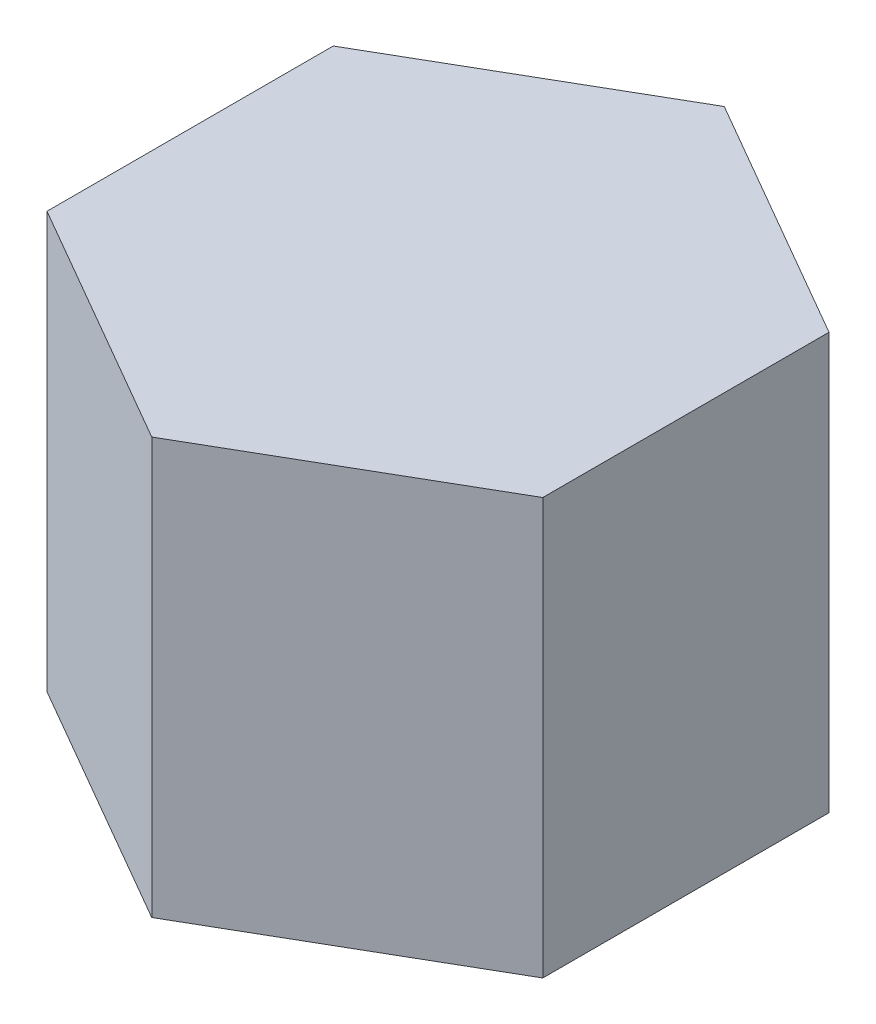
ISO-10303-21;
HEADER;
FILE_DESCRIPTION(('STEP AP214'),'2;1');
FILE_NAME('part.step','',(''),(''),'','','');
FILE_SCHEMA(('AUTOMOTIVE_DESIGN { 1 0 10303 214 1 1 1 1 }'));
ENDSEC;
DATA;
#1=APPLICATION_CONTEXT('core data for automotive mechanical design processes');
#2=APPLICATION_PROTOCOL_DEFINITION('international standard','automotive_design',2000,#1);
#3=PRODUCT_CONTEXT('',#1,'mechanical');
#4=PRODUCT('Part','Part','',(#3));
#5=PRODUCT_RELATED_PRODUCT_CATEGORY('part','',(#4));
#6=PRODUCT_DEFINITION_FORMATION('','',#4);
#7=PRODUCT_DEFINITION_CONTEXT('part definition',#1,'design');
#8=PRODUCT_DEFINITION('design','',#6,#7);
#9=PRODUCT_DEFINITION_SHAPE('','',#8);
#10=(LENGTH_UNIT() NAMED_UNIT(*) SI_UNIT(.MILLI.,.METRE.));
#11=(NAMED_UNIT(*) PLANE_ANGLE_UNIT() SI_UNIT($,.RADIAN.));
#12=(NAMED_UNIT(*) SI_UNIT($,.STERADIAN.) SOLID_ANGLE_UNIT());
#13=UNCERTAINTY_MEASURE_WITH_UNIT(LENGTH_MEASURE(1.E-05),#10,'distance_accuracy_value','');
#14=(GEOMETRIC_REPRESENTATION_CONTEXT(3) GLOBAL_UNCERTAINTY_ASSIGNED_CONTEXT((#13)) GLOBAL_UNIT_ASSIGNED_CONTEXT((#10,
#11,#12)) REPRESENTATION_CONTEXT('',''));
#15=CARTESIAN_POINT('',(0.,0.,0.));
#16=DIRECTION('',(0.,0.,1.));
#17=DIRECTION('',(1.,0.,0.));
#18=AXIS2_PLACEMENT_3D('',#15,#16,#17);
#19=CARTESIAN_POINT('',(208.839551417382,-147.556598747966,289.083895009141));
#20=DIRECTION('',(-0.499999999999978,0.,-0.866025403784452));
#21=DIRECTION('',(-0.866025403784452,0.,0.499999999999978));
#22=AXIS2_PLACEMENT_3D('',#19,#20,#21);
#23=PLANE('',#22);
#24=CARTESIAN_POINT('',(209.142660308706,-147.047793579175,288.908895009141));
#25=DIRECTION('',(-0.866025403784452,0.,0.499999999999978));
#26=VECTOR('',#25,1.);
#27=LINE('',#24,#26);
#28=CARTESIAN_POINT('',(209.142660308706,-147.047793579175,288.908895009141));
#29=VERTEX_POINT('',#28);
#30=CARTESIAN_POINT('',(208.839551417382,-147.047793579175,289.083895009141));
#31=VERTEX_POINT('',#30);
#32=EDGE_CURVE('E170',#29,#31,#27,.T.);
#33=ORIENTED_EDGE('',*,*,#32,.T.);
#34=CARTESIAN_POINT('',(208.839551417382,-147.556598747966,289.083895009141));
#35=DIRECTION('',(0.,1.,0.));
#36=VECTOR('',#35,1.);
#37=LINE('',#34,#36);
#38=CARTESIAN_POINT('',(208.839551417382,-147.556598747966,289.083895009141));
#39=VERTEX_POINT('',#38);
#40=EDGE_CURVE('E35',#39,#31,#37,.T.);
#41=ORIENTED_EDGE('',*,*,#40,.F.);
#42=CARTESIAN_POINT('',(209.142660308706,-147.556598747966,288.908895009141));
#43=DIRECTION('',(-0.866025403784452,0.,0.499999999999978));
#44=VECTOR('',#43,1.);
#45=LINE('',#42,#44);
#46=CARTESIAN_POINT('',(209.142660308706,-147.556598747966,288.908895009141));
#47=VERTEX_POINT('',#46);
#48=EDGE_CURVE('E159',#47,#39,#45,.T.);
#49=ORIENTED_EDGE('',*,*,#48,.F.);
#50=CARTESIAN_POINT('',(209.142660308706,-147.556598747966,288.908895009141));
#51=DIRECTION('',(0.,1.,0.));
#52=VECTOR('',#51,1.);
#53=LINE('',#50,#52);
#54=EDGE_CURVE('E10',#47,#29,#53,.T.);
#55=ORIENTED_EDGE('',*,*,#54,.T.);
#56=EDGE_LOOP('',(#33,#41,#49,#55));
#57=FACE_BOUND('',#56,.T.);
#58=ADVANCED_FACE('F16',(#57),#23,.F.);
#59=CARTESIAN_POINT('',(209.142660308706,-147.556598747966,291.594471220494));
#60=DIRECTION('',(-1.,0.,0.));
#61=DIRECTION('',(0.,-1.,0.));
#62=AXIS2_PLACEMENT_3D('',#59,#60,#61);
#63=PLANE('',#62);
#64=CARTESIAN_POINT('',(209.142660308706,-147.047793579175,288.558895009141));
#65=DIRECTION('',(0.,0.,1.));
#66=VECTOR('',#65,1.);
#67=LINE('',#64,#66);
#68=CARTESIAN_POINT('',(209.142660308706,-147.047793579175,288.558895009141));
#69=VERTEX_POINT('',#68);
#70=EDGE_CURVE('E167',#69,#29,#67,.T.);
#71=ORIENTED_EDGE('',*,*,#70,.T.);
#72=ORIENTED_EDGE('',*,*,#54,.F.);
#73=CARTESIAN_POINT('',(209.142660308706,-147.556598747966,288.558895009141));
#74=DIRECTION('',(0.,0.,1.));
#75=VECTOR('',#74,1.);
#76=LINE('',#73,#75);
#77=CARTESIAN_POINT('',(209.142660308706,-147.556598747966,288.558895009141));
#78=VERTEX_POINT('',#77);
#79=EDGE_CURVE('E156',#78,#47,#76,.T.);
#80=ORIENTED_EDGE('',*,*,#79,.F.);
#81=CARTESIAN_POINT('',(209.142660308706,-147.556598747966,288.558895009141));
#82=DIRECTION('',(0.,1.,0.));
#83=VECTOR('',#82,1.);
#84=LINE('',#81,#83);
#85=EDGE_CURVE('E27',#78,#69,#84,.T.);
#86=ORIENTED_EDGE('',*,*,#85,.T.);
#87=EDGE_LOOP('',(#71,#72,#80,#86));
#88=FACE_BOUND('',#87,.T.);
#89=ADVANCED_FACE('F189',(#88),#63,.F.);
#90=CARTESIAN_POINT('',(209.142660308706,-147.556598747966,288.558895009141));
#91=DIRECTION('',(-0.499999999999943,0.,0.866025403784471));
#92=DIRECTION('',(0.866025403784471,0.,0.499999999999943));
#93=AXIS2_PLACEMENT_3D('',#90,#91,#92);
#94=PLANE('',#93);
#95=CARTESIAN_POINT('',(208.839551417382,-147.047793579175,288.383895009141));
#96=DIRECTION('',(0.866025403784471,0.,0.499999999999943));
#97=VECTOR('',#96,1.);
#98=LINE('',#95,#97);
#99=CARTESIAN_POINT('',(208.839551417382,-147.047793579175,288.383895009141));
#100=VERTEX_POINT('',#99);
#101=EDGE_CURVE('E163',#100,#69,#98,.T.);
#102=ORIENTED_EDGE('',*,*,#101,.T.);
#103=ORIENTED_EDGE('',*,*,#85,.F.);
#104=CARTESIAN_POINT('',(208.839551417382,-147.556598747966,288.383895009141));
#105=DIRECTION('',(0.866025403784471,0.,0.499999999999943));
#106=VECTOR('',#105,1.);
#107=LINE('',#104,#106);
#108=CARTESIAN_POINT('',(208.839551417382,-147.556598747966,288.383895009141));
#109=VERTEX_POINT('',#108);
#110=EDGE_CURVE('E106',#109,#78,#107,.T.);
#111=ORIENTED_EDGE('',*,*,#110,.F.);
#112=CARTESIAN_POINT('',(208.839551417382,-147.556598747966,288.383895009141));
#113=DIRECTION('',(0.,1.,0.));
#114=VECTOR('',#113,1.);
#115=LINE('',#112,#114);
#116=EDGE_CURVE('E94',#109,#100,#115,.T.);
#117=ORIENTED_EDGE('',*,*,#116,.T.);
#118=EDGE_LOOP('',(#102,#103,#111,#117));
#119=FACE_BOUND('',#118,.T.);
#120=ADVANCED_FACE('F198',(#119),#94,.F.);
#121=CARTESIAN_POINT('',(208.839551417382,-147.556598747966,288.383895009141));
#122=DIRECTION('',(0.499999999999978,0.,0.866025403784452));
#123=DIRECTION('',(0.866025403784452,0.,-0.499999999999978));
#124=AXIS2_PLACEMENT_3D('',#121,#122,#123);
#125=PLANE('',#124);
#126=CARTESIAN_POINT('',(208.536442526057,-147.047793579175,288.558895009141));
#127=DIRECTION('',(0.866025403784452,0.,-0.499999999999978));
#128=VECTOR('',#127,1.);
#129=LINE('',#126,#128);
#130=CARTESIAN_POINT('',(208.536442526057,-147.047793579175,288.558895009141));
#131=VERTEX_POINT('',#130);
#132=EDGE_CURVE('E162',#131,#100,#129,.T.);
#133=ORIENTED_EDGE('',*,*,#132,.T.);
#134=ORIENTED_EDGE('',*,*,#116,.F.);
#135=CARTESIAN_POINT('',(208.536442526057,-147.556598747966,288.558895009141));
#136=DIRECTION('',(0.866025403784452,0.,-0.499999999999978));
#137=VECTOR('',#136,1.);
#138=LINE('',#135,#137);
#139=CARTESIAN_POINT('',(208.536442526057,-147.556598747966,288.558895009141));
#140=VERTEX_POINT('',#139);
#141=EDGE_CURVE('E98',#140,#109,#138,.T.);
#142=ORIENTED_EDGE('',*,*,#141,.F.);
#143=CARTESIAN_POINT('',(208.536442526057,-147.556598747966,288.558895009141));
#144=DIRECTION('',(0.,1.,0.));
#145=VECTOR('',#144,1.);
#146=LINE('',#143,#145);
#147=EDGE_CURVE('E79',#140,#131,#146,.T.);
#148=ORIENTED_EDGE('',*,*,#147,.T.);
#149=EDGE_LOOP('',(#133,#134,#142,#148));
#150=FACE_BOUND('',#149,.T.);
#151=ADVANCED_FACE('F100',(#150),#125,.F.);
#152=CARTESIAN_POINT('',(208.536442526057,-147.556598747966,291.594471220494));
#153=DIRECTION('',(1.,0.,0.));
#154=DIRECTION('',(0.,1.,0.));
#155=AXIS2_PLACEMENT_3D('',#152,#153,#154);
#156=PLANE('',#155);
#157=CARTESIAN_POINT('',(208.536442526057,-147.047793579175,288.908895009141));
#158=DIRECTION('',(0.,0.,-1.));
#159=VECTOR('',#158,1.);
#160=LINE('',#157,#159);
#161=CARTESIAN_POINT('',(208.536442526057,-147.047793579175,288.908895009141));
#162=VERTEX_POINT('',#161);
#163=EDGE_CURVE('E88',#162,#131,#160,.T.);
#164=ORIENTED_EDGE('',*,*,#163,.T.);
#165=ORIENTED_EDGE('',*,*,#147,.F.);
#166=CARTESIAN_POINT('',(208.536442526057,-147.556598747966,288.908895009141));
#167=DIRECTION('',(0.,0.,-1.));
#168=VECTOR('',#167,1.);
#169=LINE('',#166,#168);
#170=CARTESIAN_POINT('',(208.536442526057,-147.556598747966,288.908895009141));
#171=VERTEX_POINT('',#170);
#172=EDGE_CURVE('E84',#171,#140,#169,.T.);
#173=ORIENTED_EDGE('',*,*,#172,.F.);
#174=CARTESIAN_POINT('',(208.536442526057,-147.556598747966,288.908895009141));
#175=DIRECTION('',(0.,1.,0.));
#176=VECTOR('',#175,1.);
#177=LINE('',#174,#176);
#178=EDGE_CURVE('E58',#171,#162,#177,.T.);
#179=ORIENTED_EDGE('',*,*,#178,.T.);
#180=EDGE_LOOP('',(#164,#165,#173,#179));
#181=FACE_BOUND('',#180,.T.);
#182=ADVANCED_FACE('F82',(#181),#156,.F.);
#183=CARTESIAN_POINT('',(208.536442526057,-147.556598747966,288.908895009141));
#184=DIRECTION('',(0.499999999999943,0.,-0.866025403784471));
#185=DIRECTION('',(-0.866025403784471,0.,-0.499999999999943));
#186=AXIS2_PLACEMENT_3D('',#183,#184,#185);
#187=PLANE('',#186);
#188=CARTESIAN_POINT('',(208.839551417382,-147.047793579175,289.083895009141));
#189=DIRECTION('',(-0.866025403784471,0.,-0.499999999999943));
#190=VECTOR('',#189,1.);
#191=LINE('',#188,#190);
#192=EDGE_CURVE('E160',#31,#162,#191,.T.);
#193=ORIENTED_EDGE('',*,*,#192,.T.);
#194=ORIENTED_EDGE('',*,*,#178,.F.);
#195=CARTESIAN_POINT('',(208.839551417382,-147.556598747966,289.083895009141));
#196=DIRECTION('',(-0.866025403784471,0.,-0.499999999999943));
#197=VECTOR('',#196,1.);
#198=LINE('',#195,#197);
#199=EDGE_CURVE('E112',#39,#171,#198,.T.);
#200=ORIENTED_EDGE('',*,*,#199,.F.);
#201=ORIENTED_EDGE('',*,*,#40,.T.);
#202=EDGE_LOOP('',(#193,#194,#200,#201));
#203=FACE_BOUND('',#202,.T.);
#204=ADVANCED_FACE('F131',(#203),#187,.F.);
#205=CARTESIAN_POINT('',(206.491105863044,-147.556598747966,291.594471220494));
#206=DIRECTION('',(0.,1.,0.));
#207=DIRECTION('',(-1.,0.,0.));
#208=AXIS2_PLACEMENT_3D('',#205,#206,#207);
#209=PLANE('',#208);
#210=ORIENTED_EDGE('',*,*,#48,.T.);
#211=ORIENTED_EDGE('',*,*,#199,.T.);
#212=ORIENTED_EDGE('',*,*,#172,.T.);
#213=ORIENTED_EDGE('',*,*,#141,.T.);
#214=ORIENTED_EDGE('',*,*,#110,.T.);
#215=ORIENTED_EDGE('',*,*,#79,.T.);
#216=EDGE_LOOP('',(#210,#211,#212,#213,#214,#215));
#217=FACE_BOUND('',#216,.T.);
#218=ADVANCED_FACE('F111',(#217),#209,.F.);
#219=CARTESIAN_POINT('',(206.491105863044,-147.047793579175,291.594471220494));
#220=DIRECTION('',(0.,1.,0.));
#221=DIRECTION('',(-1.,0.,0.));
#222=AXIS2_PLACEMENT_3D('',#219,#220,#221);
#223=PLANE('',#222);
#224=ORIENTED_EDGE('',*,*,#32,.F.);
#225=ORIENTED_EDGE('',*,*,#70,.F.);
#226=ORIENTED_EDGE('',*,*,#101,.F.);
#227=ORIENTED_EDGE('',*,*,#132,.F.);
#228=ORIENTED_EDGE('',*,*,#163,.F.);
#229=ORIENTED_EDGE('',*,*,#192,.F.);
#230=EDGE_LOOP('',(#224,#225,#226,#227,#228,#229));
#231=FACE_BOUND('',#230,.T.);
#232=ADVANCED_FACE('F130',(#231),#223,.T.);
#233=CLOSED_SHELL('',(#58,#89,#120,#151,#182,#204,#218,#232));
#234=MANIFOLD_SOLID_BREP('B1',#233);
#235=ADVANCED_BREP_SHAPE_REPRESENTATION('',(#18,#234),#14);
#236=SHAPE_DEFINITION_REPRESENTATION(#9,#235);
ENDSEC;
END-ISO-10303-21;
